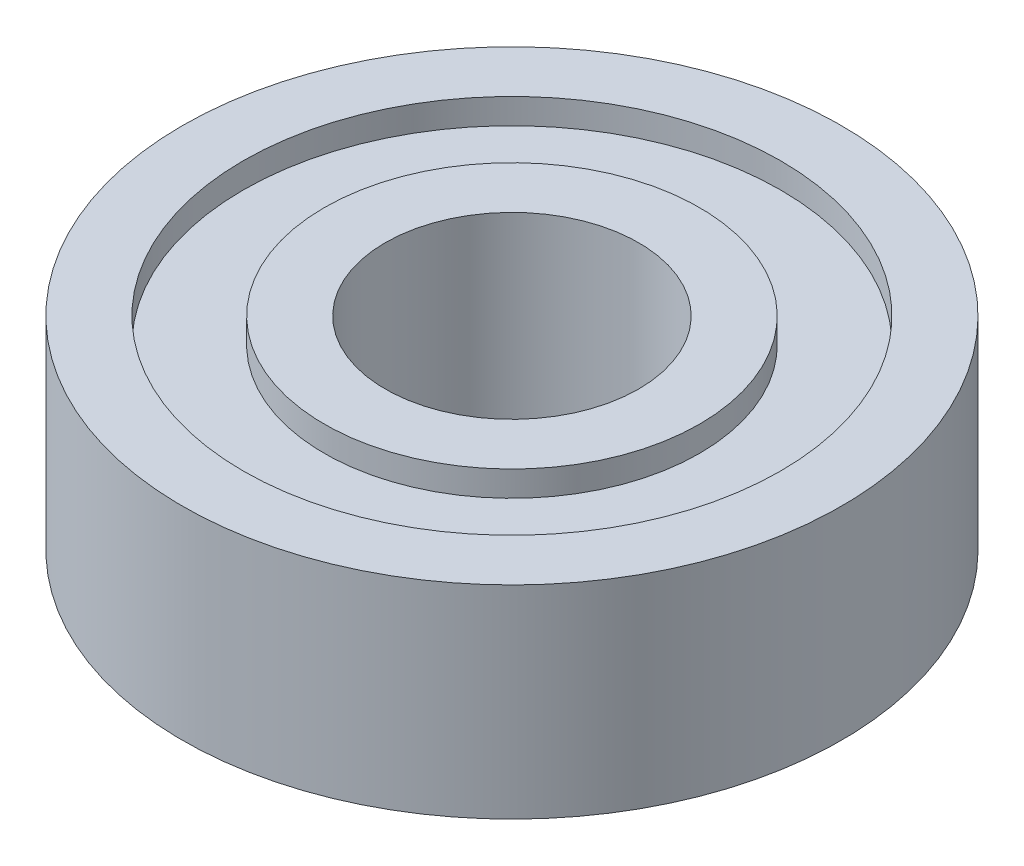
ISO-10303-21;
HEADER;
FILE_DESCRIPTION(('STEP AP214'),'2;1');
FILE_NAME('part.step','',(''),(''),'','','');
FILE_SCHEMA(('AUTOMOTIVE_DESIGN { 1 0 10303 214 1 1 1 1 }'));
ENDSEC;
DATA;
#1=APPLICATION_CONTEXT('core data for automotive mechanical design processes');
#2=APPLICATION_PROTOCOL_DEFINITION('international standard','automotive_design',2000,#1);
#3=PRODUCT_CONTEXT('',#1,'mechanical');
#4=PRODUCT('Part','Part','',(#3));
#5=PRODUCT_RELATED_PRODUCT_CATEGORY('part','',(#4));
#6=PRODUCT_DEFINITION_FORMATION('','',#4);
#7=PRODUCT_DEFINITION_CONTEXT('part definition',#1,'design');
#8=PRODUCT_DEFINITION('design','',#6,#7);
#9=PRODUCT_DEFINITION_SHAPE('','',#8);
#10=(LENGTH_UNIT() NAMED_UNIT(*) SI_UNIT(.MILLI.,.METRE.));
#11=(NAMED_UNIT(*) PLANE_ANGLE_UNIT() SI_UNIT($,.RADIAN.));
#12=(NAMED_UNIT(*) SI_UNIT($,.STERADIAN.) SOLID_ANGLE_UNIT());
#13=UNCERTAINTY_MEASURE_WITH_UNIT(LENGTH_MEASURE(1.E-05),#10,'distance_accuracy_value','');
#14=(GEOMETRIC_REPRESENTATION_CONTEXT(3) GLOBAL_UNCERTAINTY_ASSIGNED_CONTEXT((#13)) GLOBAL_UNIT_ASSIGNED_CONTEXT((#10,
#11,#12)) REPRESENTATION_CONTEXT('',''));
#15=CARTESIAN_POINT('',(0.,0.,0.));
#16=DIRECTION('',(0.,0.,1.));
#17=DIRECTION('',(1.,0.,0.));
#18=AXIS2_PLACEMENT_3D('',#15,#16,#17);
#19=CARTESIAN_POINT('',(0.,40.4736799974727,0.));
#20=DIRECTION('',(0.,1.,0.));
#21=DIRECTION('',(-1.,0.,0.));
#22=AXIS2_PLACEMENT_3D('',#19,#20,#21);
#23=CYLINDRICAL_SURFACE('',#22,6.50000000000001);
#24=CARTESIAN_POINT('',(0.,-2.,0.));
#25=DIRECTION('',(0.,1.,0.));
#26=DIRECTION('',(-1.,0.,0.));
#27=AXIS2_PLACEMENT_3D('',#24,#25,#26);
#28=CIRCLE('',#27,6.50000000000001);
#29=CARTESIAN_POINT('',(-6.5,-2.,0.));
#30=VERTEX_POINT('',#29);
#31=EDGE_CURVE('E10',#30,#30,#28,.T.);
#32=ORIENTED_EDGE('',*,*,#31,.T.);
#33=EDGE_LOOP('',(#32));
#34=FACE_BOUND('',#33,.T.);
#35=CARTESIAN_POINT('',(0.,2.,0.));
#36=DIRECTION('',(0.,1.,0.));
#37=DIRECTION('',(-1.,0.,0.));
#38=AXIS2_PLACEMENT_3D('',#35,#36,#37);
#39=CIRCLE('',#38,6.50000000000001);
#40=CARTESIAN_POINT('',(-6.5,2.,0.));
#41=VERTEX_POINT('',#40);
#42=EDGE_CURVE('E87',#41,#41,#39,.T.);
#43=ORIENTED_EDGE('',*,*,#42,.F.);
#44=EDGE_LOOP('',(#43));
#45=FACE_BOUND('',#44,.T.);
#46=ADVANCED_FACE('F36',(#34,#45),#23,.T.);
#47=CARTESIAN_POINT('',(-6.5,-2.,0.));
#48=DIRECTION('',(0.,-1.,0.));
#49=DIRECTION('',(1.,0.,0.));
#50=AXIS2_PLACEMENT_3D('',#47,#48,#49);
#51=PLANE('',#50);
#52=CARTESIAN_POINT('',(0.,-2.,0.));
#53=DIRECTION('',(0.,1.,0.));
#54=DIRECTION('',(-1.,0.,0.));
#55=AXIS2_PLACEMENT_3D('',#52,#53,#54);
#56=CIRCLE('',#55,5.30000000000001);
#57=CARTESIAN_POINT('',(-5.3,-2.,0.));
#58=VERTEX_POINT('',#57);
#59=EDGE_CURVE('E43',#58,#58,#56,.T.);
#60=ORIENTED_EDGE('',*,*,#59,.T.);
#61=EDGE_LOOP('',(#60));
#62=FACE_BOUND('',#61,.T.);
#63=ORIENTED_EDGE('',*,*,#31,.F.);
#64=EDGE_LOOP('',(#63));
#65=FACE_BOUND('',#64,.T.);
#66=ADVANCED_FACE('F96',(#62,#65),#51,.T.);
#67=CARTESIAN_POINT('',(0.,40.4736799974727,0.));
#68=DIRECTION('',(0.,1.,0.));
#69=DIRECTION('',(-1.,0.,0.));
#70=AXIS2_PLACEMENT_3D('',#67,#68,#69);
#71=CYLINDRICAL_SURFACE('',#70,5.30000000000001);
#72=CARTESIAN_POINT('',(0.,-1.5,0.));
#73=DIRECTION('',(0.,1.,0.));
#74=DIRECTION('',(-1.,0.,0.));
#75=AXIS2_PLACEMENT_3D('',#72,#73,#74);
#76=CIRCLE('',#75,5.30000000000001);
#77=CARTESIAN_POINT('',(-5.3,-1.5,0.));
#78=VERTEX_POINT('',#77);
#79=EDGE_CURVE('E50',#78,#78,#76,.T.);
#80=ORIENTED_EDGE('',*,*,#79,.T.);
#81=EDGE_LOOP('',(#80));
#82=FACE_BOUND('',#81,.T.);
#83=ORIENTED_EDGE('',*,*,#59,.F.);
#84=EDGE_LOOP('',(#83));
#85=FACE_BOUND('',#84,.T.);
#86=ADVANCED_FACE('F100',(#82,#85),#71,.F.);
#87=CARTESIAN_POINT('',(-5.3,-1.5,0.));
#88=DIRECTION('',(0.,-1.,0.));
#89=DIRECTION('',(1.,0.,0.));
#90=AXIS2_PLACEMENT_3D('',#87,#88,#89);
#91=PLANE('',#90);
#92=CARTESIAN_POINT('',(0.,-1.5,0.));
#93=DIRECTION('',(0.,1.,0.));
#94=DIRECTION('',(-1.,0.,0.));
#95=AXIS2_PLACEMENT_3D('',#92,#93,#94);
#96=CIRCLE('',#95,3.70000000000001);
#97=CARTESIAN_POINT('',(-3.7,-1.5,0.));
#98=VERTEX_POINT('',#97);
#99=EDGE_CURVE('E55',#98,#98,#96,.T.);
#100=ORIENTED_EDGE('',*,*,#99,.T.);
#101=EDGE_LOOP('',(#100));
#102=FACE_BOUND('',#101,.T.);
#103=ORIENTED_EDGE('',*,*,#79,.F.);
#104=EDGE_LOOP('',(#103));
#105=FACE_BOUND('',#104,.T.);
#106=ADVANCED_FACE('F104',(#102,#105),#91,.T.);
#107=CARTESIAN_POINT('',(0.,40.4736799974727,0.));
#108=DIRECTION('',(0.,1.,0.));
#109=DIRECTION('',(-1.,0.,0.));
#110=AXIS2_PLACEMENT_3D('',#107,#108,#109);
#111=CYLINDRICAL_SURFACE('',#110,3.70000000000001);
#112=CARTESIAN_POINT('',(0.,-2.,0.));
#113=DIRECTION('',(0.,1.,0.));
#114=DIRECTION('',(-1.,0.,0.));
#115=AXIS2_PLACEMENT_3D('',#112,#113,#114);
#116=CIRCLE('',#115,3.70000000000001);
#117=CARTESIAN_POINT('',(-3.7,-2.,0.));
#118=VERTEX_POINT('',#117);
#119=EDGE_CURVE('E60',#118,#118,#116,.T.);
#120=ORIENTED_EDGE('',*,*,#119,.T.);
#121=EDGE_LOOP('',(#120));
#122=FACE_BOUND('',#121,.T.);
#123=ORIENTED_EDGE('',*,*,#99,.F.);
#124=EDGE_LOOP('',(#123));
#125=FACE_BOUND('',#124,.T.);
#126=ADVANCED_FACE('F111',(#122,#125),#111,.T.);
#127=CARTESIAN_POINT('',(-3.7,-2.,0.));
#128=DIRECTION('',(0.,-1.,0.));
#129=DIRECTION('',(1.,0.,0.));
#130=AXIS2_PLACEMENT_3D('',#127,#128,#129);
#131=PLANE('',#130);
#132=CARTESIAN_POINT('',(0.,-2.,0.));
#133=DIRECTION('',(0.,1.,0.));
#134=DIRECTION('',(-1.,0.,0.));
#135=AXIS2_PLACEMENT_3D('',#132,#133,#134);
#136=CIRCLE('',#135,2.50000000000001);
#137=CARTESIAN_POINT('',(-2.5,-2.,0.));
#138=VERTEX_POINT('',#137);
#139=EDGE_CURVE('E63',#138,#138,#136,.T.);
#140=ORIENTED_EDGE('',*,*,#139,.T.);
#141=EDGE_LOOP('',(#140));
#142=FACE_BOUND('',#141,.T.);
#143=ORIENTED_EDGE('',*,*,#119,.F.);
#144=EDGE_LOOP('',(#143));
#145=FACE_BOUND('',#144,.T.);
#146=ADVANCED_FACE('F115',(#142,#145),#131,.T.);
#147=CARTESIAN_POINT('',(0.,40.4736799974727,0.));
#148=DIRECTION('',(0.,1.,0.));
#149=DIRECTION('',(-1.,0.,0.));
#150=AXIS2_PLACEMENT_3D('',#147,#148,#149);
#151=CYLINDRICAL_SURFACE('',#150,2.50000000000001);
#152=CARTESIAN_POINT('',(0.,2.,0.));
#153=DIRECTION('',(0.,1.,0.));
#154=DIRECTION('',(-1.,0.,0.));
#155=AXIS2_PLACEMENT_3D('',#152,#153,#154);
#156=CIRCLE('',#155,2.50000000000001);
#157=CARTESIAN_POINT('',(-2.5,2.,0.));
#158=VERTEX_POINT('',#157);
#159=EDGE_CURVE('E67',#158,#158,#156,.T.);
#160=ORIENTED_EDGE('',*,*,#159,.T.);
#161=EDGE_LOOP('',(#160));
#162=FACE_BOUND('',#161,.T.);
#163=ORIENTED_EDGE('',*,*,#139,.F.);
#164=EDGE_LOOP('',(#163));
#165=FACE_BOUND('',#164,.T.);
#166=ADVANCED_FACE('F119',(#162,#165),#151,.F.);
#167=CARTESIAN_POINT('',(-3.7,2.,0.));
#168=DIRECTION('',(0.,1.,0.));
#169=DIRECTION('',(-1.,0.,0.));
#170=AXIS2_PLACEMENT_3D('',#167,#168,#169);
#171=PLANE('',#170);
#172=CARTESIAN_POINT('',(0.,2.,0.));
#173=DIRECTION('',(0.,1.,0.));
#174=DIRECTION('',(-1.,0.,0.));
#175=AXIS2_PLACEMENT_3D('',#172,#173,#174);
#176=CIRCLE('',#175,3.70000000000001);
#177=CARTESIAN_POINT('',(-3.7,2.,0.));
#178=VERTEX_POINT('',#177);
#179=EDGE_CURVE('E71',#178,#178,#176,.T.);
#180=ORIENTED_EDGE('',*,*,#179,.T.);
#181=EDGE_LOOP('',(#180));
#182=FACE_BOUND('',#181,.T.);
#183=ORIENTED_EDGE('',*,*,#159,.F.);
#184=EDGE_LOOP('',(#183));
#185=FACE_BOUND('',#184,.T.);
#186=ADVANCED_FACE('F123',(#182,#185),#171,.T.);
#187=CARTESIAN_POINT('',(0.,40.4736799974727,0.));
#188=DIRECTION('',(0.,1.,0.));
#189=DIRECTION('',(-1.,0.,0.));
#190=AXIS2_PLACEMENT_3D('',#187,#188,#189);
#191=CYLINDRICAL_SURFACE('',#190,3.70000000000001);
#192=CARTESIAN_POINT('',(0.,1.5,0.));
#193=DIRECTION('',(0.,1.,0.));
#194=DIRECTION('',(-1.,0.,0.));
#195=AXIS2_PLACEMENT_3D('',#192,#193,#194);
#196=CIRCLE('',#195,3.70000000000001);
#197=CARTESIAN_POINT('',(-3.7,1.5,0.));
#198=VERTEX_POINT('',#197);
#199=EDGE_CURVE('E75',#198,#198,#196,.T.);
#200=ORIENTED_EDGE('',*,*,#199,.T.);
#201=EDGE_LOOP('',(#200));
#202=FACE_BOUND('',#201,.T.);
#203=ORIENTED_EDGE('',*,*,#179,.F.);
#204=EDGE_LOOP('',(#203));
#205=FACE_BOUND('',#204,.T.);
#206=ADVANCED_FACE('F127',(#202,#205),#191,.T.);
#207=CARTESIAN_POINT('',(-5.3,1.5,0.));
#208=DIRECTION('',(0.,1.,0.));
#209=DIRECTION('',(-1.,0.,0.));
#210=AXIS2_PLACEMENT_3D('',#207,#208,#209);
#211=PLANE('',#210);
#212=CARTESIAN_POINT('',(0.,1.5,0.));
#213=DIRECTION('',(0.,1.,0.));
#214=DIRECTION('',(-1.,0.,0.));
#215=AXIS2_PLACEMENT_3D('',#212,#213,#214);
#216=CIRCLE('',#215,5.30000000000001);
#217=CARTESIAN_POINT('',(-5.3,1.5,0.));
#218=VERTEX_POINT('',#217);
#219=EDGE_CURVE('E79',#218,#218,#216,.T.);
#220=ORIENTED_EDGE('',*,*,#219,.T.);
#221=EDGE_LOOP('',(#220));
#222=FACE_BOUND('',#221,.T.);
#223=ORIENTED_EDGE('',*,*,#199,.F.);
#224=EDGE_LOOP('',(#223));
#225=FACE_BOUND('',#224,.T.);
#226=ADVANCED_FACE('F131',(#222,#225),#211,.T.);
#227=CARTESIAN_POINT('',(0.,40.4736799974727,0.));
#228=DIRECTION('',(0.,1.,0.));
#229=DIRECTION('',(-1.,0.,0.));
#230=AXIS2_PLACEMENT_3D('',#227,#228,#229);
#231=CYLINDRICAL_SURFACE('',#230,5.30000000000001);
#232=CARTESIAN_POINT('',(0.,2.,0.));
#233=DIRECTION('',(0.,1.,0.));
#234=DIRECTION('',(-1.,0.,0.));
#235=AXIS2_PLACEMENT_3D('',#232,#233,#234);
#236=CIRCLE('',#235,5.30000000000001);
#237=CARTESIAN_POINT('',(-5.3,2.,0.));
#238=VERTEX_POINT('',#237);
#239=EDGE_CURVE('E83',#238,#238,#236,.T.);
#240=ORIENTED_EDGE('',*,*,#239,.T.);
#241=EDGE_LOOP('',(#240));
#242=FACE_BOUND('',#241,.T.);
#243=ORIENTED_EDGE('',*,*,#219,.F.);
#244=EDGE_LOOP('',(#243));
#245=FACE_BOUND('',#244,.T.);
#246=ADVANCED_FACE('F135',(#242,#245),#231,.F.);
#247=CARTESIAN_POINT('',(-6.5,2.,0.));
#248=DIRECTION('',(0.,1.,0.));
#249=DIRECTION('',(-1.,0.,0.));
#250=AXIS2_PLACEMENT_3D('',#247,#248,#249);
#251=PLANE('',#250);
#252=ORIENTED_EDGE('',*,*,#42,.T.);
#253=EDGE_LOOP('',(#252));
#254=FACE_BOUND('',#253,.T.);
#255=ORIENTED_EDGE('',*,*,#239,.F.);
#256=EDGE_LOOP('',(#255));
#257=FACE_BOUND('',#256,.T.);
#258=ADVANCED_FACE('F92',(#254,#257),#251,.T.);
#259=CLOSED_SHELL('',(#46,#66,#86,#106,#126,#146,#166,#186,#206,#226,#246,#258));
#260=MANIFOLD_SOLID_BREP('B2',#259);
#261=ADVANCED_BREP_SHAPE_REPRESENTATION('',(#18,#260),#14);
#262=SHAPE_DEFINITION_REPRESENTATION(#9,#261);
ENDSEC;
END-ISO-10303-21;
